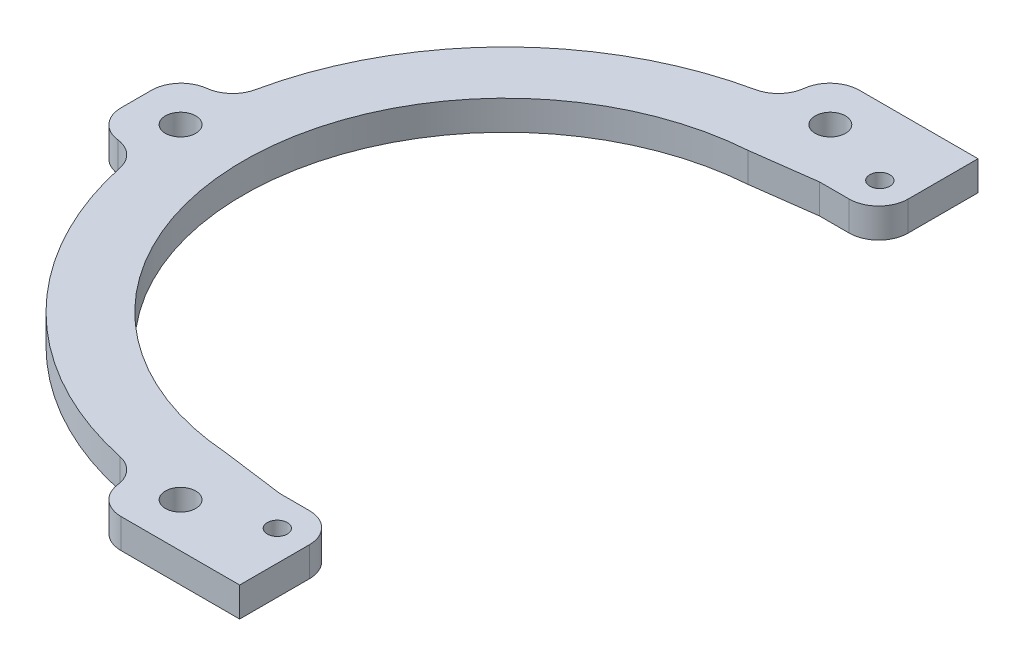
ISO-10303-21;
HEADER;
FILE_DESCRIPTION(('STEP AP214'),'2;1');
FILE_NAME('part.step','',(''),(''),'','','');
FILE_SCHEMA(('AUTOMOTIVE_DESIGN { 1 0 10303 214 1 1 1 1 }'));
ENDSEC;
DATA;
#1=APPLICATION_CONTEXT('core data for automotive mechanical design processes');
#2=APPLICATION_PROTOCOL_DEFINITION('international standard','automotive_design',2000,#1);
#3=PRODUCT_CONTEXT('',#1,'mechanical');
#4=PRODUCT('Part','Part','',(#3));
#5=PRODUCT_RELATED_PRODUCT_CATEGORY('part','',(#4));
#6=PRODUCT_DEFINITION_FORMATION('','',#4);
#7=PRODUCT_DEFINITION_CONTEXT('part definition',#1,'design');
#8=PRODUCT_DEFINITION('design','',#6,#7);
#9=PRODUCT_DEFINITION_SHAPE('','',#8);
#10=(LENGTH_UNIT() NAMED_UNIT(*) SI_UNIT(.MILLI.,.METRE.));
#11=(NAMED_UNIT(*) PLANE_ANGLE_UNIT() SI_UNIT($,.RADIAN.));
#12=(NAMED_UNIT(*) SI_UNIT($,.STERADIAN.) SOLID_ANGLE_UNIT());
#13=UNCERTAINTY_MEASURE_WITH_UNIT(LENGTH_MEASURE(1.E-05),#10,'distance_accuracy_value','');
#14=(GEOMETRIC_REPRESENTATION_CONTEXT(3) GLOBAL_UNCERTAINTY_ASSIGNED_CONTEXT((#13)) GLOBAL_UNIT_ASSIGNED_CONTEXT((#10,
#11,#12)) REPRESENTATION_CONTEXT('',''));
#15=CARTESIAN_POINT('',(0.,0.,0.));
#16=DIRECTION('',(0.,0.,1.));
#17=DIRECTION('',(1.,0.,0.));
#18=AXIS2_PLACEMENT_3D('',#15,#16,#17);
#19=CARTESIAN_POINT('',(0.,6.35,0.));
#20=DIRECTION('',(0.,-1.,0.));
#21=DIRECTION('',(0.,0.,-1.));
#22=AXIS2_PLACEMENT_3D('',#19,#20,#21);
#23=CYLINDRICAL_SURFACE('',#22,69.85);
#24=CARTESIAN_POINT('',(0.,0.,0.));
#25=DIRECTION('',(0.,1.,0.));
#26=DIRECTION('',(0.,0.,1.));
#27=AXIS2_PLACEMENT_3D('',#24,#25,#26);
#28=CIRCLE('',#27,69.85);
#29=CARTESIAN_POINT('',(-68.3173431176866,0.,14.5520833333336));
#30=VERTEX_POINT('',#29);
#31=CARTESIAN_POINT('',(-14.5520833333333,0.,68.3173431176866));
#32=VERTEX_POINT('',#31);
#33=EDGE_CURVE('E317',#30,#32,#28,.T.);
#34=ORIENTED_EDGE('',*,*,#33,.T.);
#35=DIRECTION('',(0.,-1.,0.));
#36=VECTOR('',#35,1.);
#37=CARTESIAN_POINT('',(-14.5520833333333,6.35,68.3173431176866));
#38=LINE('',#37,#36);
#39=CARTESIAN_POINT('',(-14.5520833333333,6.35,68.3173431176866));
#40=VERTEX_POINT('',#39);
#41=EDGE_CURVE('E362',#32,#40,#38,.F.);
#42=ORIENTED_EDGE('',*,*,#41,.T.);
#43=CARTESIAN_POINT('',(0.,6.35,0.));
#44=DIRECTION('',(0.,1.,0.));
#45=DIRECTION('',(0.,0.,1.));
#46=AXIS2_PLACEMENT_3D('',#43,#44,#45);
#47=CIRCLE('',#46,69.85);
#48=CARTESIAN_POINT('',(-68.3173431176866,6.35,14.5520833333336));
#49=VERTEX_POINT('',#48);
#50=EDGE_CURVE('E325',#49,#40,#47,.T.);
#51=ORIENTED_EDGE('',*,*,#50,.F.);
#52=DIRECTION('',(0.,-1.,0.));
#53=VECTOR('',#52,1.);
#54=CARTESIAN_POINT('',(-68.3173431176866,6.35,14.5520833333336));
#55=LINE('',#54,#53);
#56=EDGE_CURVE('E344',#49,#30,#55,.T.);
#57=ORIENTED_EDGE('',*,*,#56,.T.);
#58=EDGE_LOOP('',(#34,#42,#51,#57));
#59=FACE_BOUND('',#58,.T.);
#60=ADVANCED_FACE('F39',(#59),#23,.T.);
#61=CARTESIAN_POINT('',(0.,6.35,0.));
#62=DIRECTION('',(0.,1.,0.));
#63=DIRECTION('',(0.,0.,1.));
#64=AXIS2_PLACEMENT_3D('',#61,#62,#63);
#65=PLANE('',#64);
#66=CARTESIAN_POINT('',(15.7226,6.35,64.77));
#67=DIRECTION('',(0.,-1.,0.));
#68=DIRECTION('',(0.,0.,-1.));
#69=AXIS2_PLACEMENT_3D('',#66,#67,#68);
#70=CIRCLE('',#69,2.15265000000001);
#71=CARTESIAN_POINT('',(15.7226,6.35,62.61735));
#72=VERTEX_POINT('',#71);
#73=EDGE_CURVE('E542',#72,#72,#70,.T.);
#74=ORIENTED_EDGE('',*,*,#73,.T.);
#75=EDGE_LOOP('',(#74));
#76=FACE_BOUND('',#75,.T.);
#77=CARTESIAN_POINT('',(15.7226,6.35,-64.77));
#78=DIRECTION('',(0.,1.,0.));
#79=DIRECTION('',(0.,0.,1.));
#80=AXIS2_PLACEMENT_3D('',#77,#78,#79);
#81=CIRCLE('',#80,2.15265000000001);
#82=CARTESIAN_POINT('',(15.7226,6.35,-62.61735));
#83=VERTEX_POINT('',#82);
#84=EDGE_CURVE('E225',#83,#83,#81,.T.);
#85=ORIENTED_EDGE('',*,*,#84,.F.);
#86=EDGE_LOOP('',(#85));
#87=FACE_BOUND('',#86,.T.);
#88=DIRECTION('',(0.,0.,1.));
#89=VECTOR('',#88,1.);
#90=CARTESIAN_POINT('',(22.225,6.35,58.0180106738399));
#91=LINE('',#90,#89);
#92=CARTESIAN_POINT('',(22.225,6.35,64.3680106738399));
#93=VERTEX_POINT('',#92);
#94=CARTESIAN_POINT('',(22.225,6.35,79.375));
#95=VERTEX_POINT('',#94);
#96=EDGE_CURVE('E188',#93,#95,#91,.T.);
#97=ORIENTED_EDGE('',*,*,#96,.F.);
#98=CARTESIAN_POINT('',(15.875,6.35,64.3680106738399));
#99=DIRECTION('',(0.,1.,0.));
#100=DIRECTION('',(0.,0.,1.));
#101=AXIS2_PLACEMENT_3D('',#98,#99,#100);
#102=CIRCLE('',#101,6.35);
#103=CARTESIAN_POINT('',(15.875,6.35,58.0180106738399));
#104=VERTEX_POINT('',#103);
#105=EDGE_CURVE('E444',#93,#104,#102,.T.);
#106=ORIENTED_EDGE('',*,*,#105,.T.);
#107=DIRECTION('',(-1.,0.,0.));
#108=VECTOR('',#107,1.);
#109=CARTESIAN_POINT('',(22.225,6.35,58.0180106738399));
#110=LINE('',#109,#108);
#111=CARTESIAN_POINT('',(9.525,6.35,58.0180106738399));
#112=VERTEX_POINT('',#111);
#113=EDGE_CURVE('E216',#104,#112,#110,.T.);
#114=ORIENTED_EDGE('',*,*,#113,.T.);
#115=DIRECTION('',(0.991253595663899,0.,0.131970864524677));
#116=VECTOR('',#115,1.);
#117=CARTESIAN_POINT('',(-10.7949999999999,6.35,55.3127009742112));
#118=LINE('',#117,#116);
#119=CARTESIAN_POINT('',(-4.0526564039989,6.35,56.2103450454952));
#120=VERTEX_POINT('',#119);
#121=EDGE_CURVE('E255',#120,#112,#118,.T.);
#122=ORIENTED_EDGE('',*,*,#121,.F.);
#123=CARTESIAN_POINT('',(0.,6.35,0.));
#124=DIRECTION('',(0.,1.,0.));
#125=DIRECTION('',(0.,0.,1.));
#126=AXIS2_PLACEMENT_3D('',#123,#124,#125);
#127=CIRCLE('',#126,56.35625);
#128=CARTESIAN_POINT('',(-4.0526564039989,6.35,-56.2103450454952));
#129=VERTEX_POINT('',#128);
#130=EDGE_CURVE('E314',#129,#120,#127,.T.);
#131=ORIENTED_EDGE('',*,*,#130,.F.);
#132=DIRECTION('',(-0.991253595663899,0.,0.131970864524677));
#133=VECTOR('',#132,1.);
#134=CARTESIAN_POINT('',(-10.7949999999999,6.35,-55.3127009742112));
#135=LINE('',#134,#133);
#136=CARTESIAN_POINT('',(9.52500000000006,6.35,-58.0180106738399));
#137=VERTEX_POINT('',#136);
#138=EDGE_CURVE('E249',#137,#129,#135,.T.);
#139=ORIENTED_EDGE('',*,*,#138,.F.);
#140=DIRECTION('',(-1.,0.,0.));
#141=VECTOR('',#140,1.);
#142=CARTESIAN_POINT('',(22.225,6.35,-58.0180106738399));
#143=LINE('',#142,#141);
#144=CARTESIAN_POINT('',(15.875,6.35,-58.0180106738399));
#145=VERTEX_POINT('',#144);
#146=EDGE_CURVE('E246',#145,#137,#143,.T.);
#147=ORIENTED_EDGE('',*,*,#146,.F.);
#148=CARTESIAN_POINT('',(15.875,6.35,-64.3680106738399));
#149=DIRECTION('',(0.,1.,0.));
#150=DIRECTION('',(0.,0.,1.));
#151=AXIS2_PLACEMENT_3D('',#148,#149,#150);
#152=CIRCLE('',#151,6.35);
#153=CARTESIAN_POINT('',(22.225,6.35,-64.3680106738399));
#154=VERTEX_POINT('',#153);
#155=EDGE_CURVE('E55',#145,#154,#152,.T.);
#156=ORIENTED_EDGE('',*,*,#155,.T.);
#157=DIRECTION('',(0.,0.,-1.));
#158=VECTOR('',#157,1.);
#159=CARTESIAN_POINT('',(22.225,6.35,-58.0180106738399));
#160=LINE('',#159,#158);
#161=CARTESIAN_POINT('',(22.225,6.35,-79.375));
#162=VERTEX_POINT('',#161);
#163=EDGE_CURVE('E240',#154,#162,#160,.T.);
#164=ORIENTED_EDGE('',*,*,#163,.T.);
#165=DIRECTION('',(-1.,0.,0.));
#166=VECTOR('',#165,1.);
#167=CARTESIAN_POINT('',(-9.525,6.35,-79.375));
#168=LINE('',#167,#166);
#169=CARTESIAN_POINT('',(-3.26425224602747,6.35,-79.375));
#170=VERTEX_POINT('',#169);
#171=EDGE_CURVE('E302',#162,#170,#168,.T.);
#172=ORIENTED_EDGE('',*,*,#171,.T.);
#173=CARTESIAN_POINT('',(-3.26425224602747,6.35,-73.025));
#174=DIRECTION('',(0.,1.,0.));
#175=DIRECTION('',(0.,0.,1.));
#176=AXIS2_PLACEMENT_3D('',#173,#174,#175);
#177=CIRCLE('',#176,6.35);
#178=CARTESIAN_POINT('',(-9.56962612301373,6.35,-73.77650533692));
#179=VERTEX_POINT('',#178);
#180=EDGE_CURVE('E383',#170,#179,#177,.T.);
#181=ORIENTED_EDGE('',*,*,#180,.T.);
#182=CARTESIAN_POINT('',(-15.875,6.35,-74.5280106738399));
#183=DIRECTION('',(0.,1.,0.));
#184=DIRECTION('',(0.,0.,1.));
#185=AXIS2_PLACEMENT_3D('',#182,#183,#184);
#186=CIRCLE('',#185,6.35);
#187=CARTESIAN_POINT('',(-14.5520833333333,6.35,-68.3173431176866));
#188=VERTEX_POINT('',#187);
#189=EDGE_CURVE('E337',#179,#188,#186,.F.);
#190=ORIENTED_EDGE('',*,*,#189,.T.);
#191=CARTESIAN_POINT('',(-68.3173431176867,6.35,-14.5520833333331));
#192=VERTEX_POINT('',#191);
#193=EDGE_CURVE('E320',#188,#192,#47,.T.);
#194=ORIENTED_EDGE('',*,*,#193,.T.);
#195=CARTESIAN_POINT('',(-74.52801067384,6.35,-15.8749999999997));
#196=DIRECTION('',(0.,1.,0.));
#197=DIRECTION('',(0.,0.,1.));
#198=AXIS2_PLACEMENT_3D('',#195,#196,#197);
#199=CIRCLE('',#198,6.35);
#200=CARTESIAN_POINT('',(-73.77650533692,6.35,-9.56962612301348));
#201=VERTEX_POINT('',#200);
#202=EDGE_CURVE('E348',#192,#201,#199,.F.);
#203=ORIENTED_EDGE('',*,*,#202,.T.);
#204=CARTESIAN_POINT('',(-73.025,6.35,-3.26425224602722));
#205=DIRECTION('',(0.,1.,0.));
#206=DIRECTION('',(0.,0.,1.));
#207=AXIS2_PLACEMENT_3D('',#204,#205,#206);
#208=CIRCLE('',#207,6.35);
#209=CARTESIAN_POINT('',(-79.375,6.35,-3.26425224602719));
#210=VERTEX_POINT('',#209);
#211=EDGE_CURVE('E386',#201,#210,#208,.T.);
#212=ORIENTED_EDGE('',*,*,#211,.T.);
#213=DIRECTION('',(0.,0.,1.));
#214=VECTOR('',#213,1.);
#215=CARTESIAN_POINT('',(-79.375,6.35,9.52500000000028));
#216=LINE('',#215,#214);
#217=CARTESIAN_POINT('',(-79.375,6.35,3.26425224602775));
#218=VERTEX_POINT('',#217);
#219=EDGE_CURVE('E296',#210,#218,#216,.T.);
#220=ORIENTED_EDGE('',*,*,#219,.T.);
#221=CARTESIAN_POINT('',(-73.025,6.35,3.26425224602772));
#222=DIRECTION('',(0.,1.,0.));
#223=DIRECTION('',(0.,0.,1.));
#224=AXIS2_PLACEMENT_3D('',#221,#222,#223);
#225=CIRCLE('',#224,6.35);
#226=CARTESIAN_POINT('',(-73.7765053369199,6.35,9.56962612301399));
#227=VERTEX_POINT('',#226);
#228=EDGE_CURVE('E389',#218,#227,#225,.T.);
#229=ORIENTED_EDGE('',*,*,#228,.T.);
#230=CARTESIAN_POINT('',(-74.5280106738399,6.35,15.8750000000003));
#231=DIRECTION('',(0.,1.,0.));
#232=DIRECTION('',(0.,0.,1.));
#233=AXIS2_PLACEMENT_3D('',#230,#231,#232);
#234=CIRCLE('',#233,6.35);
#235=EDGE_CURVE('E359',#227,#49,#234,.F.);
#236=ORIENTED_EDGE('',*,*,#235,.T.);
#237=ORIENTED_EDGE('',*,*,#50,.T.);
#238=CARTESIAN_POINT('',(-15.875,6.35,74.5280106738399));
#239=DIRECTION('',(0.,1.,0.));
#240=DIRECTION('',(0.,0.,1.));
#241=AXIS2_PLACEMENT_3D('',#238,#239,#240);
#242=CIRCLE('',#241,6.35);
#243=CARTESIAN_POINT('',(-9.56962612301373,6.35,73.77650533692));
#244=VERTEX_POINT('',#243);
#245=EDGE_CURVE('E366',#40,#244,#242,.F.);
#246=ORIENTED_EDGE('',*,*,#245,.T.);
#247=CARTESIAN_POINT('',(-3.26425224602747,6.35,73.025));
#248=DIRECTION('',(0.,1.,0.));
#249=DIRECTION('',(0.,0.,1.));
#250=AXIS2_PLACEMENT_3D('',#247,#248,#249);
#251=CIRCLE('',#250,6.35);
#252=CARTESIAN_POINT('',(-3.26425224602747,6.35,79.375));
#253=VERTEX_POINT('',#252);
#254=EDGE_CURVE('E205',#244,#253,#251,.T.);
#255=ORIENTED_EDGE('',*,*,#254,.T.);
#256=DIRECTION('',(1.,0.,0.));
#257=VECTOR('',#256,1.);
#258=CARTESIAN_POINT('',(9.525,6.35,79.375));
#259=LINE('',#258,#257);
#260=EDGE_CURVE('E201',#253,#95,#259,.T.);
#261=ORIENTED_EDGE('',*,*,#260,.T.);
#262=EDGE_LOOP('',(#97,#106,#114,#122,#131,#139,#147,#156,#164,#172,#181,#190,#194,#203,#212,
#220,#229,#236,#237,#246,#255,#261));
#263=FACE_BOUND('',#262,.T.);
#264=CARTESIAN_POINT('',(-69.85,6.35,2.43879971518193E-13));
#265=DIRECTION('',(0.,-1.,0.));
#266=DIRECTION('',(-1.,0.,0.));
#267=AXIS2_PLACEMENT_3D('',#264,#265,#266);
#268=CIRCLE('',#267,3.2639);
#269=CARTESIAN_POINT('',(-73.1139,6.35,2.55275817460043E-13));
#270=VERTEX_POINT('',#269);
#271=EDGE_CURVE('E273',#270,#270,#268,.T.);
#272=ORIENTED_EDGE('',*,*,#271,.T.);
#273=EDGE_LOOP('',(#272));
#274=FACE_BOUND('',#273,.T.);
#275=CARTESIAN_POINT('',(0.,6.35,69.85));
#276=DIRECTION('',(0.,-1.,0.));
#277=DIRECTION('',(0.,0.,1.));
#278=AXIS2_PLACEMENT_3D('',#275,#276,#277);
#279=CIRCLE('',#278,3.2639);
#280=CARTESIAN_POINT('',(0.,6.35,73.1139));
#281=VERTEX_POINT('',#280);
#282=EDGE_CURVE('E282',#281,#281,#279,.T.);
#283=ORIENTED_EDGE('',*,*,#282,.T.);
#284=EDGE_LOOP('',(#283));
#285=FACE_BOUND('',#284,.T.);
#286=CARTESIAN_POINT('',(0.,6.35,-69.85));
#287=DIRECTION('',(0.,-1.,0.));
#288=DIRECTION('',(0.,0.,-1.));
#289=AXIS2_PLACEMENT_3D('',#286,#287,#288);
#290=CIRCLE('',#289,3.2639);
#291=CARTESIAN_POINT('',(0.,6.35,-73.1139));
#292=VERTEX_POINT('',#291);
#293=EDGE_CURVE('E210',#292,#292,#290,.T.);
#294=ORIENTED_EDGE('',*,*,#293,.T.);
#295=EDGE_LOOP('',(#294));
#296=FACE_BOUND('',#295,.T.);
#297=ADVANCED_FACE('F202',(#76,#87,#263,#274,#285,#296),#65,.T.);
#298=CARTESIAN_POINT('',(0.,0.,0.));
#299=DIRECTION('',(0.,1.,0.));
#300=DIRECTION('',(0.,0.,1.));
#301=AXIS2_PLACEMENT_3D('',#298,#299,#300);
#302=PLANE('',#301);
#303=CARTESIAN_POINT('',(15.7226,0.,64.77));
#304=DIRECTION('',(0.,-1.,0.));
#305=DIRECTION('',(0.,0.,-1.));
#306=AXIS2_PLACEMENT_3D('',#303,#304,#305);
#307=CIRCLE('',#306,2.15265000000001);
#308=CARTESIAN_POINT('',(15.7226,0.,62.61735));
#309=VERTEX_POINT('',#308);
#310=EDGE_CURVE('E539',#309,#309,#307,.T.);
#311=ORIENTED_EDGE('',*,*,#310,.F.);
#312=EDGE_LOOP('',(#311));
#313=FACE_BOUND('',#312,.T.);
#314=CARTESIAN_POINT('',(15.7226,0.,-64.77));
#315=DIRECTION('',(0.,1.,0.));
#316=DIRECTION('',(0.,0.,1.));
#317=AXIS2_PLACEMENT_3D('',#314,#315,#316);
#318=CIRCLE('',#317,2.15265000000001);
#319=CARTESIAN_POINT('',(15.7226,0.,-62.61735));
#320=VERTEX_POINT('',#319);
#321=EDGE_CURVE('E226',#320,#320,#318,.T.);
#322=ORIENTED_EDGE('',*,*,#321,.T.);
#323=EDGE_LOOP('',(#322));
#324=FACE_BOUND('',#323,.T.);
#325=CARTESIAN_POINT('',(-69.85,0.,2.43879971518193E-13));
#326=DIRECTION('',(0.,-1.,0.));
#327=DIRECTION('',(-1.,0.,0.));
#328=AXIS2_PLACEMENT_3D('',#325,#326,#327);
#329=CIRCLE('',#328,3.2639);
#330=CARTESIAN_POINT('',(-73.1139,0.,2.55275817460043E-13));
#331=VERTEX_POINT('',#330);
#332=EDGE_CURVE('E278',#331,#331,#329,.T.);
#333=ORIENTED_EDGE('',*,*,#332,.F.);
#334=EDGE_LOOP('',(#333));
#335=FACE_BOUND('',#334,.T.);
#336=CARTESIAN_POINT('',(0.,0.,69.85));
#337=DIRECTION('',(0.,-1.,0.));
#338=DIRECTION('',(0.,0.,1.));
#339=AXIS2_PLACEMENT_3D('',#336,#337,#338);
#340=CIRCLE('',#339,3.2639);
#341=CARTESIAN_POINT('',(0.,0.,73.1139));
#342=VERTEX_POINT('',#341);
#343=EDGE_CURVE('E269',#342,#342,#340,.T.);
#344=ORIENTED_EDGE('',*,*,#343,.F.);
#345=EDGE_LOOP('',(#344));
#346=FACE_BOUND('',#345,.T.);
#347=CARTESIAN_POINT('',(0.,0.,-69.85));
#348=DIRECTION('',(0.,-1.,0.));
#349=DIRECTION('',(0.,0.,-1.));
#350=AXIS2_PLACEMENT_3D('',#347,#348,#349);
#351=CIRCLE('',#350,3.2639);
#352=CARTESIAN_POINT('',(0.,0.,-73.1139));
#353=VERTEX_POINT('',#352);
#354=EDGE_CURVE('E277',#353,#353,#351,.T.);
#355=ORIENTED_EDGE('',*,*,#354,.F.);
#356=EDGE_LOOP('',(#355));
#357=FACE_BOUND('',#356,.T.);
#358=DIRECTION('',(-1.,0.,0.));
#359=VECTOR('',#358,1.);
#360=CARTESIAN_POINT('',(22.225,0.,58.0180106738399));
#361=LINE('',#360,#359);
#362=CARTESIAN_POINT('',(15.875,0.,58.0180106738399));
#363=VERTEX_POINT('',#362);
#364=CARTESIAN_POINT('',(9.52500000000006,0.,58.0180106738399));
#365=VERTEX_POINT('',#364);
#366=EDGE_CURVE('E219',#363,#365,#361,.T.);
#367=ORIENTED_EDGE('',*,*,#366,.F.);
#368=CARTESIAN_POINT('',(15.875,0.,64.3680106738399));
#369=DIRECTION('',(0.,1.,0.));
#370=DIRECTION('',(0.,0.,1.));
#371=AXIS2_PLACEMENT_3D('',#368,#369,#370);
#372=CIRCLE('',#371,6.35);
#373=CARTESIAN_POINT('',(22.225,0.,64.3680106738399));
#374=VERTEX_POINT('',#373);
#375=EDGE_CURVE('E437',#363,#374,#372,.F.);
#376=ORIENTED_EDGE('',*,*,#375,.T.);
#377=DIRECTION('',(0.,0.,1.));
#378=VECTOR('',#377,1.);
#379=CARTESIAN_POINT('',(22.225,0.,58.0180106738399));
#380=LINE('',#379,#378);
#381=CARTESIAN_POINT('',(22.225,0.,79.375));
#382=VERTEX_POINT('',#381);
#383=EDGE_CURVE('E198',#374,#382,#380,.T.);
#384=ORIENTED_EDGE('',*,*,#383,.T.);
#385=DIRECTION('',(1.,0.,0.));
#386=VECTOR('',#385,1.);
#387=CARTESIAN_POINT('',(9.525,0.,79.375));
#388=LINE('',#387,#386);
#389=CARTESIAN_POINT('',(-3.26425224602747,0.,79.375));
#390=VERTEX_POINT('',#389);
#391=EDGE_CURVE('E209',#390,#382,#388,.T.);
#392=ORIENTED_EDGE('',*,*,#391,.F.);
#393=CARTESIAN_POINT('',(-3.26425224602747,0.,73.025));
#394=DIRECTION('',(0.,1.,0.));
#395=DIRECTION('',(0.,0.,1.));
#396=AXIS2_PLACEMENT_3D('',#393,#394,#395);
#397=CIRCLE('',#396,6.35);
#398=CARTESIAN_POINT('',(-9.56962612301373,0.,73.77650533692));
#399=VERTEX_POINT('',#398);
#400=EDGE_CURVE('E406',#390,#399,#397,.F.);
#401=ORIENTED_EDGE('',*,*,#400,.T.);
#402=CARTESIAN_POINT('',(-15.875,0.,74.5280106738399));
#403=DIRECTION('',(0.,1.,0.));
#404=DIRECTION('',(0.,0.,1.));
#405=AXIS2_PLACEMENT_3D('',#402,#403,#404);
#406=CIRCLE('',#405,6.35);
#407=EDGE_CURVE('E369',#399,#32,#406,.T.);
#408=ORIENTED_EDGE('',*,*,#407,.T.);
#409=ORIENTED_EDGE('',*,*,#33,.F.);
#410=CARTESIAN_POINT('',(-74.5280106738399,0.,15.8750000000003));
#411=DIRECTION('',(0.,1.,0.));
#412=DIRECTION('',(0.,0.,1.));
#413=AXIS2_PLACEMENT_3D('',#410,#411,#412);
#414=CIRCLE('',#413,6.35);
#415=CARTESIAN_POINT('',(-73.7765053369199,0.,9.56962612301399));
#416=VERTEX_POINT('',#415);
#417=EDGE_CURVE('E355',#30,#416,#414,.T.);
#418=ORIENTED_EDGE('',*,*,#417,.T.);
#419=CARTESIAN_POINT('',(-73.025,0.,3.26425224602772));
#420=DIRECTION('',(0.,1.,0.));
#421=DIRECTION('',(0.,0.,1.));
#422=AXIS2_PLACEMENT_3D('',#419,#420,#421);
#423=CIRCLE('',#422,6.35);
#424=CARTESIAN_POINT('',(-79.375,0.,3.26425224602775));
#425=VERTEX_POINT('',#424);
#426=EDGE_CURVE('E403',#416,#425,#423,.F.);
#427=ORIENTED_EDGE('',*,*,#426,.T.);
#428=DIRECTION('',(0.,0.,1.));
#429=VECTOR('',#428,1.);
#430=CARTESIAN_POINT('',(-79.375,0.,9.52500000000028));
#431=LINE('',#430,#429);
#432=CARTESIAN_POINT('',(-79.375,0.,-3.26425224602719));
#433=VERTEX_POINT('',#432);
#434=EDGE_CURVE('E298',#433,#425,#431,.T.);
#435=ORIENTED_EDGE('',*,*,#434,.F.);
#436=CARTESIAN_POINT('',(-73.025,0.,-3.26425224602722));
#437=DIRECTION('',(0.,1.,0.));
#438=DIRECTION('',(0.,0.,1.));
#439=AXIS2_PLACEMENT_3D('',#436,#437,#438);
#440=CIRCLE('',#439,6.35);
#441=CARTESIAN_POINT('',(-73.77650533692,0.,-9.56962612301348));
#442=VERTEX_POINT('',#441);
#443=EDGE_CURVE('E400',#433,#442,#440,.F.);
#444=ORIENTED_EDGE('',*,*,#443,.T.);
#445=CARTESIAN_POINT('',(-74.52801067384,0.,-15.8749999999997));
#446=DIRECTION('',(0.,1.,0.));
#447=DIRECTION('',(0.,0.,1.));
#448=AXIS2_PLACEMENT_3D('',#445,#446,#447);
#449=CIRCLE('',#448,6.35);
#450=CARTESIAN_POINT('',(-68.3173431176867,0.,-14.5520833333331));
#451=VERTEX_POINT('',#450);
#452=EDGE_CURVE('E352',#442,#451,#449,.T.);
#453=ORIENTED_EDGE('',*,*,#452,.T.);
#454=CARTESIAN_POINT('',(-14.5520833333333,0.,-68.3173431176866));
#455=VERTEX_POINT('',#454);
#456=EDGE_CURVE('E326',#455,#451,#28,.T.);
#457=ORIENTED_EDGE('',*,*,#456,.F.);
#458=CARTESIAN_POINT('',(-15.875,0.,-74.5280106738399));
#459=DIRECTION('',(0.,1.,0.));
#460=DIRECTION('',(0.,0.,1.));
#461=AXIS2_PLACEMENT_3D('',#458,#459,#460);
#462=CIRCLE('',#461,6.35);
#463=CARTESIAN_POINT('',(-9.56962612301373,0.,-73.77650533692));
#464=VERTEX_POINT('',#463);
#465=EDGE_CURVE('E333',#455,#464,#462,.T.);
#466=ORIENTED_EDGE('',*,*,#465,.T.);
#467=CARTESIAN_POINT('',(-3.26425224602747,0.,-73.025));
#468=DIRECTION('',(0.,1.,0.));
#469=DIRECTION('',(0.,0.,1.));
#470=AXIS2_PLACEMENT_3D('',#467,#468,#469);
#471=CIRCLE('',#470,6.35);
#472=CARTESIAN_POINT('',(-3.26425224602747,0.,-79.375));
#473=VERTEX_POINT('',#472);
#474=EDGE_CURVE('E397',#464,#473,#471,.F.);
#475=ORIENTED_EDGE('',*,*,#474,.T.);
#476=DIRECTION('',(-1.,0.,0.));
#477=VECTOR('',#476,1.);
#478=CARTESIAN_POINT('',(-9.525,0.,-79.375));
#479=LINE('',#478,#477);
#480=CARTESIAN_POINT('',(22.225,0.,-79.375));
#481=VERTEX_POINT('',#480);
#482=EDGE_CURVE('E306',#481,#473,#479,.T.);
#483=ORIENTED_EDGE('',*,*,#482,.F.);
#484=DIRECTION('',(0.,0.,-1.));
#485=VECTOR('',#484,1.);
#486=CARTESIAN_POINT('',(22.225,0.,-58.0180106738399));
#487=LINE('',#486,#485);
#488=CARTESIAN_POINT('',(22.225,0.,-64.3680106738399));
#489=VERTEX_POINT('',#488);
#490=EDGE_CURVE('E230',#489,#481,#487,.T.);
#491=ORIENTED_EDGE('',*,*,#490,.F.);
#492=CARTESIAN_POINT('',(15.875,0.,-64.3680106738399));
#493=DIRECTION('',(0.,1.,0.));
#494=DIRECTION('',(0.,0.,1.));
#495=AXIS2_PLACEMENT_3D('',#492,#493,#494);
#496=CIRCLE('',#495,6.35);
#497=CARTESIAN_POINT('',(15.875,0.,-58.0180106738399));
#498=VERTEX_POINT('',#497);
#499=EDGE_CURVE('E434',#489,#498,#496,.F.);
#500=ORIENTED_EDGE('',*,*,#499,.T.);
#501=DIRECTION('',(-1.,0.,0.));
#502=VECTOR('',#501,1.);
#503=CARTESIAN_POINT('',(22.225,0.,-58.0180106738399));
#504=LINE('',#503,#502);
#505=CARTESIAN_POINT('',(9.525,0.,-58.0180106738399));
#506=VERTEX_POINT('',#505);
#507=EDGE_CURVE('E243',#498,#506,#504,.T.);
#508=ORIENTED_EDGE('',*,*,#507,.T.);
#509=DIRECTION('',(-0.991253595663899,0.,0.131970864524677));
#510=VECTOR('',#509,1.);
#511=CARTESIAN_POINT('',(-10.7949999999999,0.,-55.3127009742112));
#512=LINE('',#511,#510);
#513=CARTESIAN_POINT('',(-4.0526564039989,0.,-56.2103450454952));
#514=VERTEX_POINT('',#513);
#515=EDGE_CURVE('E250',#506,#514,#512,.T.);
#516=ORIENTED_EDGE('',*,*,#515,.T.);
#517=CARTESIAN_POINT('',(0.,0.,0.));
#518=DIRECTION('',(0.,1.,0.));
#519=DIRECTION('',(0.,0.,1.));
#520=AXIS2_PLACEMENT_3D('',#517,#518,#519);
#521=CIRCLE('',#520,56.35625);
#522=CARTESIAN_POINT('',(-4.0526564039989,0.,56.2103450454952));
#523=VERTEX_POINT('',#522);
#524=EDGE_CURVE('E310',#514,#523,#521,.T.);
#525=ORIENTED_EDGE('',*,*,#524,.T.);
#526=DIRECTION('',(0.991253595663899,0.,0.131970864524677));
#527=VECTOR('',#526,1.);
#528=CARTESIAN_POINT('',(-10.7949999999999,0.,55.3127009742112));
#529=LINE('',#528,#527);
#530=EDGE_CURVE('E254',#523,#365,#529,.T.);
#531=ORIENTED_EDGE('',*,*,#530,.T.);
#532=EDGE_LOOP('',(#367,#376,#384,#392,#401,#408,#409,#418,#427,#435,#444,#453,#457,#466,#475,
#483,#491,#500,#508,#516,#525,#531));
#533=FACE_BOUND('',#532,.T.);
#534=ADVANCED_FACE('F457',(#313,#324,#335,#346,#357,#533),#302,.F.);
#535=ORIENTED_EDGE('',*,*,#456,.T.);
#536=DIRECTION('',(0.,-1.,0.));
#537=VECTOR('',#536,1.);
#538=CARTESIAN_POINT('',(-68.3173431176867,6.35,-14.5520833333331));
#539=LINE('',#538,#537);
#540=EDGE_CURVE('E340',#451,#192,#539,.F.);
#541=ORIENTED_EDGE('',*,*,#540,.T.);
#542=ORIENTED_EDGE('',*,*,#193,.F.);
#543=DIRECTION('',(0.,-1.,0.));
#544=VECTOR('',#543,1.);
#545=CARTESIAN_POINT('',(-14.5520833333333,6.35,-68.3173431176866));
#546=LINE('',#545,#544);
#547=EDGE_CURVE('E324',#188,#455,#546,.T.);
#548=ORIENTED_EDGE('',*,*,#547,.T.);
#549=EDGE_LOOP('',(#535,#541,#542,#548));
#550=FACE_BOUND('',#549,.T.);
#551=ADVANCED_FACE('F486',(#550),#23,.T.);
#552=CARTESIAN_POINT('',(0.,6.35,0.));
#553=DIRECTION('',(0.,-1.,0.));
#554=DIRECTION('',(0.,0.,-1.));
#555=AXIS2_PLACEMENT_3D('',#552,#553,#554);
#556=CYLINDRICAL_SURFACE('',#555,56.35625);
#557=DIRECTION('',(0.,-1.,0.));
#558=VECTOR('',#557,1.);
#559=CARTESIAN_POINT('',(-4.0526564039989,6.35,-56.2103450454952));
#560=LINE('',#559,#558);
#561=EDGE_CURVE('E372',#129,#514,#560,.T.);
#562=ORIENTED_EDGE('',*,*,#561,.F.);
#563=ORIENTED_EDGE('',*,*,#130,.T.);
#564=DIRECTION('',(0.,-1.,0.));
#565=VECTOR('',#564,1.);
#566=CARTESIAN_POINT('',(-4.0526564039989,6.35,56.2103450454952));
#567=LINE('',#566,#565);
#568=EDGE_CURVE('E375',#523,#120,#567,.F.);
#569=ORIENTED_EDGE('',*,*,#568,.F.);
#570=ORIENTED_EDGE('',*,*,#524,.F.);
#571=EDGE_LOOP('',(#562,#563,#569,#570));
#572=FACE_BOUND('',#571,.T.);
#573=ADVANCED_FACE('F496',(#572),#556,.F.);
#574=CARTESIAN_POINT('',(-9.525,0.,-79.375));
#575=DIRECTION('',(0.,0.,-1.));
#576=DIRECTION('',(-1.,0.,0.));
#577=AXIS2_PLACEMENT_3D('',#574,#575,#576);
#578=PLANE('',#577);
#579=ORIENTED_EDGE('',*,*,#482,.T.);
#580=DIRECTION('',(0.,1.,0.));
#581=VECTOR('',#580,1.);
#582=CARTESIAN_POINT('',(-3.26425224602747,6.35,-79.375));
#583=LINE('',#582,#581);
#584=EDGE_CURVE('E423',#473,#170,#583,.T.);
#585=ORIENTED_EDGE('',*,*,#584,.T.);
#586=ORIENTED_EDGE('',*,*,#171,.F.);
#587=DIRECTION('',(0.,-1.,0.));
#588=VECTOR('',#587,1.);
#589=CARTESIAN_POINT('',(22.225,6.35,-79.375));
#590=LINE('',#589,#588);
#591=EDGE_CURVE('E236',#162,#481,#590,.T.);
#592=ORIENTED_EDGE('',*,*,#591,.T.);
#593=EDGE_LOOP('',(#579,#585,#586,#592));
#594=FACE_BOUND('',#593,.T.);
#595=ADVANCED_FACE('F462',(#594),#578,.T.);
#596=CARTESIAN_POINT('',(-15.875,6.35,-74.5280106738399));
#597=DIRECTION('',(0.,-1.,0.));
#598=DIRECTION('',(0.,0.,-1.));
#599=AXIS2_PLACEMENT_3D('',#596,#597,#598);
#600=CYLINDRICAL_SURFACE('',#599,6.35);
#601=ORIENTED_EDGE('',*,*,#189,.F.);
#602=DIRECTION('',(0.,-1.,0.));
#603=VECTOR('',#602,1.);
#604=CARTESIAN_POINT('',(-9.56962612301374,6.35,-73.77650533692));
#605=LINE('',#604,#603);
#606=EDGE_CURVE('E427',#179,#464,#605,.T.);
#607=ORIENTED_EDGE('',*,*,#606,.T.);
#608=ORIENTED_EDGE('',*,*,#465,.F.);
#609=ORIENTED_EDGE('',*,*,#547,.F.);
#610=EDGE_LOOP('',(#601,#607,#608,#609));
#611=FACE_BOUND('',#610,.T.);
#612=ADVANCED_FACE('F469',(#611),#600,.F.);
#613=CARTESIAN_POINT('',(-79.375,0.,9.52500000000028));
#614=DIRECTION('',(-1.,0.,0.));
#615=DIRECTION('',(0.,0.,1.));
#616=AXIS2_PLACEMENT_3D('',#613,#614,#615);
#617=PLANE('',#616);
#618=ORIENTED_EDGE('',*,*,#434,.T.);
#619=DIRECTION('',(0.,1.,0.));
#620=VECTOR('',#619,1.);
#621=CARTESIAN_POINT('',(-79.375,6.35,3.26425224602775));
#622=LINE('',#621,#620);
#623=EDGE_CURVE('E412',#425,#218,#622,.T.);
#624=ORIENTED_EDGE('',*,*,#623,.T.);
#625=ORIENTED_EDGE('',*,*,#219,.F.);
#626=DIRECTION('',(0.,1.,0.));
#627=VECTOR('',#626,1.);
#628=CARTESIAN_POINT('',(-79.375,0.,-3.26425224602719));
#629=LINE('',#628,#627);
#630=EDGE_CURVE('E409',#210,#433,#629,.F.);
#631=ORIENTED_EDGE('',*,*,#630,.T.);
#632=EDGE_LOOP('',(#618,#624,#625,#631));
#633=FACE_BOUND('',#632,.T.);
#634=ADVANCED_FACE('F514',(#633),#617,.T.);
#635=CARTESIAN_POINT('',(9.525,0.,79.375));
#636=DIRECTION('',(0.,0.,1.));
#637=DIRECTION('',(1.,0.,0.));
#638=AXIS2_PLACEMENT_3D('',#635,#636,#637);
#639=PLANE('',#638);
#640=ORIENTED_EDGE('',*,*,#260,.F.);
#641=DIRECTION('',(0.,1.,0.));
#642=VECTOR('',#641,1.);
#643=CARTESIAN_POINT('',(-3.26425224602747,0.,79.375));
#644=LINE('',#643,#642);
#645=EDGE_CURVE('E394',#253,#390,#644,.F.);
#646=ORIENTED_EDGE('',*,*,#645,.T.);
#647=ORIENTED_EDGE('',*,*,#391,.T.);
#648=DIRECTION('',(0.,-1.,0.));
#649=VECTOR('',#648,1.);
#650=CARTESIAN_POINT('',(22.225,6.35,79.375));
#651=LINE('',#650,#649);
#652=EDGE_CURVE('E193',#95,#382,#651,.T.);
#653=ORIENTED_EDGE('',*,*,#652,.F.);
#654=EDGE_LOOP('',(#640,#646,#647,#653));
#655=FACE_BOUND('',#654,.T.);
#656=ADVANCED_FACE('F213',(#655),#639,.T.);
#657=CARTESIAN_POINT('',(-74.52801067384,6.35,-15.8749999999997));
#658=DIRECTION('',(0.,-1.,0.));
#659=DIRECTION('',(0.,0.,-1.));
#660=AXIS2_PLACEMENT_3D('',#657,#658,#659);
#661=CYLINDRICAL_SURFACE('',#660,6.35);
#662=ORIENTED_EDGE('',*,*,#452,.F.);
#663=DIRECTION('',(0.,-1.,0.));
#664=VECTOR('',#663,1.);
#665=CARTESIAN_POINT('',(-73.77650533692,6.35,-9.56962612301348));
#666=LINE('',#665,#664);
#667=EDGE_CURVE('E419',#442,#201,#666,.F.);
#668=ORIENTED_EDGE('',*,*,#667,.T.);
#669=ORIENTED_EDGE('',*,*,#202,.F.);
#670=ORIENTED_EDGE('',*,*,#540,.F.);
#671=EDGE_LOOP('',(#662,#668,#669,#670));
#672=FACE_BOUND('',#671,.T.);
#673=ADVANCED_FACE('F509',(#672),#661,.F.);
#674=CARTESIAN_POINT('',(-74.5280106738399,6.35,15.8750000000003));
#675=DIRECTION('',(0.,-1.,0.));
#676=DIRECTION('',(0.,0.,-1.));
#677=AXIS2_PLACEMENT_3D('',#674,#675,#676);
#678=CYLINDRICAL_SURFACE('',#677,6.35);
#679=ORIENTED_EDGE('',*,*,#235,.F.);
#680=DIRECTION('',(0.,-1.,0.));
#681=VECTOR('',#680,1.);
#682=CARTESIAN_POINT('',(-73.7765053369199,6.35,9.56962612301399));
#683=LINE('',#682,#681);
#684=EDGE_CURVE('E416',#227,#416,#683,.T.);
#685=ORIENTED_EDGE('',*,*,#684,.T.);
#686=ORIENTED_EDGE('',*,*,#417,.F.);
#687=ORIENTED_EDGE('',*,*,#56,.F.);
#688=EDGE_LOOP('',(#679,#685,#686,#687));
#689=FACE_BOUND('',#688,.T.);
#690=ADVANCED_FACE('F526',(#689),#678,.F.);
#691=CARTESIAN_POINT('',(-15.875,6.35,74.5280106738399));
#692=DIRECTION('',(0.,-1.,0.));
#693=DIRECTION('',(0.,0.,-1.));
#694=AXIS2_PLACEMENT_3D('',#691,#692,#693);
#695=CYLINDRICAL_SURFACE('',#694,6.35);
#696=ORIENTED_EDGE('',*,*,#407,.F.);
#697=DIRECTION('',(0.,-1.,0.));
#698=VECTOR('',#697,1.);
#699=CARTESIAN_POINT('',(-9.56962612301374,6.35,73.77650533692));
#700=LINE('',#699,#698);
#701=EDGE_CURVE('E379',#399,#244,#700,.F.);
#702=ORIENTED_EDGE('',*,*,#701,.T.);
#703=ORIENTED_EDGE('',*,*,#245,.F.);
#704=ORIENTED_EDGE('',*,*,#41,.F.);
#705=EDGE_LOOP('',(#696,#702,#703,#704));
#706=FACE_BOUND('',#705,.T.);
#707=ADVANCED_FACE('F533',(#706),#695,.F.);
#708=CARTESIAN_POINT('',(0.,6.35,-69.85));
#709=DIRECTION('',(0.,-1.,0.));
#710=DIRECTION('',(0.,0.,-1.));
#711=AXIS2_PLACEMENT_3D('',#708,#709,#710);
#712=CYLINDRICAL_SURFACE('',#711,3.2639);
#713=ORIENTED_EDGE('',*,*,#293,.F.);
#714=EDGE_LOOP('',(#713));
#715=FACE_BOUND('',#714,.T.);
#716=ORIENTED_EDGE('',*,*,#354,.T.);
#717=EDGE_LOOP('',(#716));
#718=FACE_BOUND('',#717,.T.);
#719=ADVANCED_FACE('F587',(#715,#718),#712,.F.);
#720=CARTESIAN_POINT('',(0.,6.35,69.85));
#721=DIRECTION('',(0.,-1.,0.));
#722=DIRECTION('',(0.,0.,-1.));
#723=AXIS2_PLACEMENT_3D('',#720,#721,#722);
#724=CYLINDRICAL_SURFACE('',#723,3.2639);
#725=ORIENTED_EDGE('',*,*,#282,.F.);
#726=EDGE_LOOP('',(#725));
#727=FACE_BOUND('',#726,.T.);
#728=ORIENTED_EDGE('',*,*,#343,.T.);
#729=EDGE_LOOP('',(#728));
#730=FACE_BOUND('',#729,.T.);
#731=ADVANCED_FACE('F583',(#727,#730),#724,.F.);
#732=CARTESIAN_POINT('',(-69.85,6.35,2.43879971518193E-13));
#733=DIRECTION('',(0.,-1.,0.));
#734=DIRECTION('',(0.,0.,-1.));
#735=AXIS2_PLACEMENT_3D('',#732,#733,#734);
#736=CYLINDRICAL_SURFACE('',#735,3.2639);
#737=ORIENTED_EDGE('',*,*,#271,.F.);
#738=EDGE_LOOP('',(#737));
#739=FACE_BOUND('',#738,.T.);
#740=ORIENTED_EDGE('',*,*,#332,.T.);
#741=EDGE_LOOP('',(#740));
#742=FACE_BOUND('',#741,.T.);
#743=ADVANCED_FACE('F576',(#739,#742),#736,.F.);
#744=CARTESIAN_POINT('',(-10.7949999999999,0.,55.3127009742112));
#745=DIRECTION('',(-0.131970864524677,0.,0.991253595663899));
#746=DIRECTION('',(0.991253595663899,0.,0.131970864524677));
#747=AXIS2_PLACEMENT_3D('',#744,#745,#746);
#748=PLANE('',#747);
#749=ORIENTED_EDGE('',*,*,#568,.T.);
#750=ORIENTED_EDGE('',*,*,#121,.T.);
#751=DIRECTION('',(0.,1.,0.));
#752=VECTOR('',#751,1.);
#753=CARTESIAN_POINT('',(9.52500000000006,0.,58.0180106738399));
#754=LINE('',#753,#752);
#755=EDGE_CURVE('E265',#365,#112,#754,.T.);
#756=ORIENTED_EDGE('',*,*,#755,.F.);
#757=ORIENTED_EDGE('',*,*,#530,.F.);
#758=EDGE_LOOP('',(#749,#750,#756,#757));
#759=FACE_BOUND('',#758,.T.);
#760=ADVANCED_FACE('F572',(#759),#748,.F.);
#761=CARTESIAN_POINT('',(-10.7949999999999,0.,-55.3127009742112));
#762=DIRECTION('',(-0.131970864524677,0.,-0.991253595663899));
#763=DIRECTION('',(-0.991253595663899,0.,0.131970864524677));
#764=AXIS2_PLACEMENT_3D('',#761,#762,#763);
#765=PLANE('',#764);
#766=ORIENTED_EDGE('',*,*,#561,.T.);
#767=ORIENTED_EDGE('',*,*,#515,.F.);
#768=DIRECTION('',(0.,1.,0.));
#769=VECTOR('',#768,1.);
#770=CARTESIAN_POINT('',(9.52500000000006,0.,-58.0180106738399));
#771=LINE('',#770,#769);
#772=EDGE_CURVE('E259',#506,#137,#771,.T.);
#773=ORIENTED_EDGE('',*,*,#772,.T.);
#774=ORIENTED_EDGE('',*,*,#138,.T.);
#775=EDGE_LOOP('',(#766,#767,#773,#774));
#776=FACE_BOUND('',#775,.T.);
#777=ADVANCED_FACE('F575',(#776),#765,.F.);
#778=CARTESIAN_POINT('',(-3.26425224602747,6.35,73.025));
#779=DIRECTION('',(0.,-1.,0.));
#780=DIRECTION('',(0.,0.,-1.));
#781=AXIS2_PLACEMENT_3D('',#778,#779,#780);
#782=CYLINDRICAL_SURFACE('',#781,6.35);
#783=ORIENTED_EDGE('',*,*,#400,.F.);
#784=ORIENTED_EDGE('',*,*,#645,.F.);
#785=ORIENTED_EDGE('',*,*,#254,.F.);
#786=ORIENTED_EDGE('',*,*,#701,.F.);
#787=EDGE_LOOP('',(#783,#784,#785,#786));
#788=FACE_BOUND('',#787,.T.);
#789=ADVANCED_FACE('F537',(#788),#782,.T.);
#790=CARTESIAN_POINT('',(-73.025,6.35,3.26425224602772));
#791=DIRECTION('',(0.,-1.,0.));
#792=DIRECTION('',(0.,0.,-1.));
#793=AXIS2_PLACEMENT_3D('',#790,#791,#792);
#794=CYLINDRICAL_SURFACE('',#793,6.35);
#795=ORIENTED_EDGE('',*,*,#426,.F.);
#796=ORIENTED_EDGE('',*,*,#684,.F.);
#797=ORIENTED_EDGE('',*,*,#228,.F.);
#798=ORIENTED_EDGE('',*,*,#623,.F.);
#799=EDGE_LOOP('',(#795,#796,#797,#798));
#800=FACE_BOUND('',#799,.T.);
#801=ADVANCED_FACE('F480',(#800),#794,.T.);
#802=CARTESIAN_POINT('',(-73.025,6.35,-3.26425224602722));
#803=DIRECTION('',(0.,-1.,0.));
#804=DIRECTION('',(0.,0.,-1.));
#805=AXIS2_PLACEMENT_3D('',#802,#803,#804);
#806=CYLINDRICAL_SURFACE('',#805,6.35);
#807=ORIENTED_EDGE('',*,*,#443,.F.);
#808=ORIENTED_EDGE('',*,*,#630,.F.);
#809=ORIENTED_EDGE('',*,*,#211,.F.);
#810=ORIENTED_EDGE('',*,*,#667,.F.);
#811=EDGE_LOOP('',(#807,#808,#809,#810));
#812=FACE_BOUND('',#811,.T.);
#813=ADVANCED_FACE('F473',(#812),#806,.T.);
#814=CARTESIAN_POINT('',(-3.26425224602747,6.35,-73.025));
#815=DIRECTION('',(0.,-1.,0.));
#816=DIRECTION('',(0.,0.,-1.));
#817=AXIS2_PLACEMENT_3D('',#814,#815,#816);
#818=CYLINDRICAL_SURFACE('',#817,6.35);
#819=ORIENTED_EDGE('',*,*,#474,.F.);
#820=ORIENTED_EDGE('',*,*,#606,.F.);
#821=ORIENTED_EDGE('',*,*,#180,.F.);
#822=ORIENTED_EDGE('',*,*,#584,.F.);
#823=EDGE_LOOP('',(#819,#820,#821,#822));
#824=FACE_BOUND('',#823,.T.);
#825=ADVANCED_FACE('F470',(#824),#818,.T.);
#826=CARTESIAN_POINT('',(22.225,6.35,-58.0180106738399));
#827=DIRECTION('',(0.,0.,-1.));
#828=DIRECTION('',(-1.,0.,0.));
#829=AXIS2_PLACEMENT_3D('',#826,#827,#828);
#830=PLANE('',#829);
#831=ORIENTED_EDGE('',*,*,#507,.F.);
#832=DIRECTION('',(0.,-1.,0.));
#833=VECTOR('',#832,1.);
#834=CARTESIAN_POINT('',(15.875,6.35,-58.0180106738399));
#835=LINE('',#834,#833);
#836=EDGE_CURVE('E11',#498,#145,#835,.F.);
#837=ORIENTED_EDGE('',*,*,#836,.T.);
#838=ORIENTED_EDGE('',*,*,#146,.T.);
#839=ORIENTED_EDGE('',*,*,#772,.F.);
#840=EDGE_LOOP('',(#831,#837,#838,#839));
#841=FACE_BOUND('',#840,.T.);
#842=ADVANCED_FACE('F472',(#841),#830,.F.);
#843=CARTESIAN_POINT('',(22.225,0.,0.));
#844=DIRECTION('',(-1.,0.,0.));
#845=DIRECTION('',(0.,0.,1.));
#846=AXIS2_PLACEMENT_3D('',#843,#844,#845);
#847=PLANE('',#846);
#848=ORIENTED_EDGE('',*,*,#163,.F.);
#849=DIRECTION('',(0.,-1.,0.));
#850=VECTOR('',#849,1.);
#851=CARTESIAN_POINT('',(22.225,0.,-64.3680106738399));
#852=LINE('',#851,#850);
#853=EDGE_CURVE('E48',#154,#489,#852,.T.);
#854=ORIENTED_EDGE('',*,*,#853,.T.);
#855=ORIENTED_EDGE('',*,*,#490,.T.);
#856=ORIENTED_EDGE('',*,*,#591,.F.);
#857=EDGE_LOOP('',(#848,#854,#855,#856));
#858=FACE_BOUND('',#857,.T.);
#859=ADVANCED_FACE('F451',(#858),#847,.F.);
#860=CARTESIAN_POINT('',(15.7226,0.,-64.77));
#861=DIRECTION('',(0.,1.,0.));
#862=DIRECTION('',(0.,0.,1.));
#863=AXIS2_PLACEMENT_3D('',#860,#861,#862);
#864=CYLINDRICAL_SURFACE('',#863,2.15265000000001);
#865=ORIENTED_EDGE('',*,*,#321,.F.);
#866=EDGE_LOOP('',(#865));
#867=FACE_BOUND('',#866,.T.);
#868=ORIENTED_EDGE('',*,*,#84,.T.);
#869=EDGE_LOOP('',(#868));
#870=FACE_BOUND('',#869,.T.);
#871=ADVANCED_FACE('F565',(#867,#870),#864,.F.);
#872=CARTESIAN_POINT('',(22.225,6.35,58.0180106738399));
#873=DIRECTION('',(0.,0.,-1.));
#874=DIRECTION('',(-1.,0.,0.));
#875=AXIS2_PLACEMENT_3D('',#872,#873,#874);
#876=PLANE('',#875);
#877=ORIENTED_EDGE('',*,*,#113,.F.);
#878=DIRECTION('',(0.,-1.,0.));
#879=VECTOR('',#878,1.);
#880=CARTESIAN_POINT('',(15.875,0.,58.0180106738399));
#881=LINE('',#880,#879);
#882=EDGE_CURVE('E430',#104,#363,#881,.T.);
#883=ORIENTED_EDGE('',*,*,#882,.T.);
#884=ORIENTED_EDGE('',*,*,#366,.T.);
#885=ORIENTED_EDGE('',*,*,#755,.T.);
#886=EDGE_LOOP('',(#877,#883,#884,#885));
#887=FACE_BOUND('',#886,.T.);
#888=ADVANCED_FACE('F560',(#887),#876,.T.);
#889=CARTESIAN_POINT('',(22.225,0.,0.));
#890=DIRECTION('',(-1.,0.,0.));
#891=DIRECTION('',(0.,0.,-1.));
#892=AXIS2_PLACEMENT_3D('',#889,#890,#891);
#893=PLANE('',#892);
#894=ORIENTED_EDGE('',*,*,#383,.F.);
#895=DIRECTION('',(0.,-1.,0.));
#896=VECTOR('',#895,1.);
#897=CARTESIAN_POINT('',(22.225,6.35,64.3680106738399));
#898=LINE('',#897,#896);
#899=EDGE_CURVE('E195',#374,#93,#898,.F.);
#900=ORIENTED_EDGE('',*,*,#899,.T.);
#901=ORIENTED_EDGE('',*,*,#96,.T.);
#902=ORIENTED_EDGE('',*,*,#652,.T.);
#903=EDGE_LOOP('',(#894,#900,#901,#902));
#904=FACE_BOUND('',#903,.T.);
#905=ADVANCED_FACE('F191',(#904),#893,.F.);
#906=CARTESIAN_POINT('',(15.7226,0.,64.77));
#907=DIRECTION('',(0.,1.,0.));
#908=DIRECTION('',(0.,0.,1.));
#909=AXIS2_PLACEMENT_3D('',#906,#907,#908);
#910=CYLINDRICAL_SURFACE('',#909,2.15265000000001);
#911=ORIENTED_EDGE('',*,*,#310,.T.);
#912=EDGE_LOOP('',(#911));
#913=FACE_BOUND('',#912,.T.);
#914=ORIENTED_EDGE('',*,*,#73,.F.);
#915=EDGE_LOOP('',(#914));
#916=FACE_BOUND('',#915,.T.);
#917=ADVANCED_FACE('F550',(#913,#916),#910,.F.);
#918=CARTESIAN_POINT('',(15.875,6.35,64.3680106738399));
#919=DIRECTION('',(0.,1.,0.));
#920=DIRECTION('',(0.,0.,1.));
#921=AXIS2_PLACEMENT_3D('',#918,#919,#920);
#922=CYLINDRICAL_SURFACE('',#921,6.35);
#923=ORIENTED_EDGE('',*,*,#105,.F.);
#924=ORIENTED_EDGE('',*,*,#899,.F.);
#925=ORIENTED_EDGE('',*,*,#375,.F.);
#926=ORIENTED_EDGE('',*,*,#882,.F.);
#927=EDGE_LOOP('',(#923,#924,#925,#926));
#928=FACE_BOUND('',#927,.T.);
#929=ADVANCED_FACE('F552',(#928),#922,.T.);
#930=CARTESIAN_POINT('',(15.875,0.,-64.3680106738399));
#931=DIRECTION('',(0.,-1.,0.));
#932=DIRECTION('',(0.,0.,-1.));
#933=AXIS2_PLACEMENT_3D('',#930,#931,#932);
#934=CYLINDRICAL_SURFACE('',#933,6.35);
#935=ORIENTED_EDGE('',*,*,#155,.F.);
#936=ORIENTED_EDGE('',*,*,#836,.F.);
#937=ORIENTED_EDGE('',*,*,#499,.F.);
#938=ORIENTED_EDGE('',*,*,#853,.F.);
#939=EDGE_LOOP('',(#935,#936,#937,#938));
#940=FACE_BOUND('',#939,.T.);
#941=ADVANCED_FACE('F41',(#940),#934,.T.);
#942=CLOSED_SHELL('',(#60,#297,#534,#551,#573,#595,#612,#634,#656,#673,#690,#707,#719,#731,#743,
#760,#777,#789,#801,#813,#825,#842,#859,#871,#888,#905,#917,#929,#941));
#943=MANIFOLD_SOLID_BREP('B2',#942);
#944=ADVANCED_BREP_SHAPE_REPRESENTATION('',(#18,#943),#14);
#945=SHAPE_DEFINITION_REPRESENTATION(#9,#944);
ENDSEC;
END-ISO-10303-21;
